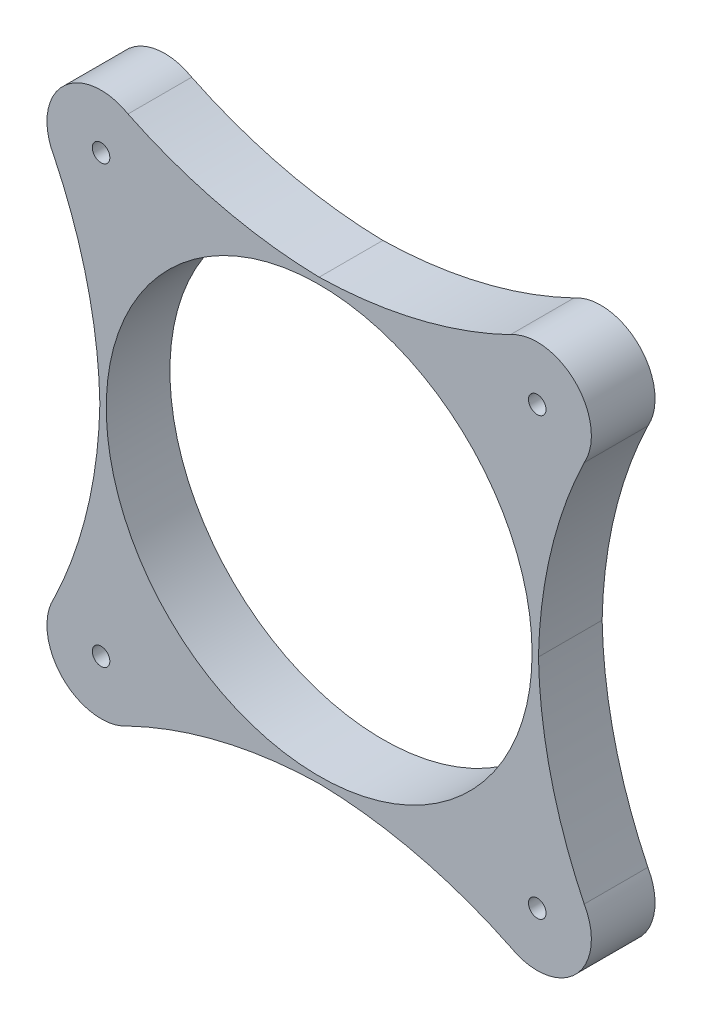
ISO-10303-21;
HEADER;
FILE_DESCRIPTION(('STEP AP214'),'2;1');
FILE_NAME('part.step','',(''),(''),'','','');
FILE_SCHEMA(('AUTOMOTIVE_DESIGN { 1 0 10303 214 1 1 1 1 }'));
ENDSEC;
DATA;
#1=APPLICATION_CONTEXT('core data for automotive mechanical design processes');
#2=APPLICATION_PROTOCOL_DEFINITION('international standard','automotive_design',2000,#1);
#3=PRODUCT_CONTEXT('',#1,'mechanical');
#4=PRODUCT('Part','Part','',(#3));
#5=PRODUCT_RELATED_PRODUCT_CATEGORY('part','',(#4));
#6=PRODUCT_DEFINITION_FORMATION('','',#4);
#7=PRODUCT_DEFINITION_CONTEXT('part definition',#1,'design');
#8=PRODUCT_DEFINITION('design','',#6,#7);
#9=PRODUCT_DEFINITION_SHAPE('','',#8);
#10=(LENGTH_UNIT() NAMED_UNIT(*) SI_UNIT(.MILLI.,.METRE.));
#11=(NAMED_UNIT(*) PLANE_ANGLE_UNIT() SI_UNIT($,.RADIAN.));
#12=(NAMED_UNIT(*) SI_UNIT($,.STERADIAN.) SOLID_ANGLE_UNIT());
#13=UNCERTAINTY_MEASURE_WITH_UNIT(LENGTH_MEASURE(1.E-05),#10,'distance_accuracy_value','');
#14=(GEOMETRIC_REPRESENTATION_CONTEXT(3) GLOBAL_UNCERTAINTY_ASSIGNED_CONTEXT((#13)) GLOBAL_UNIT_ASSIGNED_CONTEXT((#10,
#11,#12)) REPRESENTATION_CONTEXT('',''));
#15=CARTESIAN_POINT('',(0.,0.,0.));
#16=DIRECTION('',(0.,0.,1.));
#17=DIRECTION('',(1.,0.,0.));
#18=AXIS2_PLACEMENT_3D('',#15,#16,#17);
#19=CARTESIAN_POINT('',(-179.289571714901,41.6193978731311,25.4));
#20=DIRECTION('',(0.,0.,1.));
#21=DIRECTION('',(1.,0.,0.));
#22=AXIS2_PLACEMENT_3D('',#19,#20,#21);
#23=PLANE('',#22);
#24=CARTESIAN_POINT('',(86.9962311728574,86.9962311728574,25.4));
#25=DIRECTION('',(0.,0.,-1.));
#26=DIRECTION('',(-1.,0.,0.));
#27=AXIS2_PLACEMENT_3D('',#24,#25,#26);
#28=CIRCLE('',#27,3.50000000000004);
#29=CARTESIAN_POINT('',(83.4962311728574,86.9962311728574,25.4));
#30=VERTEX_POINT('',#29);
#31=EDGE_CURVE('E333',#30,#30,#28,.T.);
#32=ORIENTED_EDGE('',*,*,#31,.T.);
#33=EDGE_LOOP('',(#32));
#34=FACE_BOUND('',#33,.T.);
#35=CARTESIAN_POINT('',(-86.9962311728574,86.9962311728574,25.4));
#36=DIRECTION('',(0.,0.,-1.));
#37=DIRECTION('',(-1.,0.,0.));
#38=AXIS2_PLACEMENT_3D('',#35,#36,#37);
#39=CIRCLE('',#38,3.50000000000004);
#40=CARTESIAN_POINT('',(-90.4962311728575,86.9962311728574,25.4));
#41=VERTEX_POINT('',#40);
#42=EDGE_CURVE('E344',#41,#41,#39,.T.);
#43=ORIENTED_EDGE('',*,*,#42,.T.);
#44=EDGE_LOOP('',(#43));
#45=FACE_BOUND('',#44,.T.);
#46=CARTESIAN_POINT('',(-86.9962311728574,-86.9962311728574,25.4));
#47=DIRECTION('',(0.,0.,-1.));
#48=DIRECTION('',(-1.,0.,0.));
#49=AXIS2_PLACEMENT_3D('',#46,#47,#48);
#50=CIRCLE('',#49,3.50000000000004);
#51=CARTESIAN_POINT('',(-90.4962311728575,-86.9962311728574,25.4));
#52=VERTEX_POINT('',#51);
#53=EDGE_CURVE('E356',#52,#52,#50,.T.);
#54=ORIENTED_EDGE('',*,*,#53,.T.);
#55=EDGE_LOOP('',(#54));
#56=FACE_BOUND('',#55,.T.);
#57=CARTESIAN_POINT('',(86.9962311728574,-86.9962311728574,25.4));
#58=DIRECTION('',(0.,0.,-1.));
#59=DIRECTION('',(-1.,0.,0.));
#60=AXIS2_PLACEMENT_3D('',#57,#58,#59);
#61=CIRCLE('',#60,3.50000000000004);
#62=CARTESIAN_POINT('',(83.4962311728574,-86.9962311728574,25.4));
#63=VERTEX_POINT('',#62);
#64=EDGE_CURVE('E368',#63,#63,#61,.T.);
#65=ORIENTED_EDGE('',*,*,#64,.T.);
#66=EDGE_LOOP('',(#65));
#67=FACE_BOUND('',#66,.T.);
#68=CARTESIAN_POINT('',(-86.9962311728574,86.9962311728574,25.4));
#69=DIRECTION('',(0.,0.,1.));
#70=DIRECTION('',(1.,0.,0.));
#71=AXIS2_PLACEMENT_3D('',#68,#69,#70);
#72=CIRCLE('',#71,21.5899999999997);
#73=CARTESIAN_POINT('',(-76.2460057365222,105.719498864903,25.4));
#74=VERTEX_POINT('',#73);
#75=CARTESIAN_POINT('',(-105.719498864904,76.2460057365258,25.4));
#76=VERTEX_POINT('',#75);
#77=EDGE_CURVE('E181',#74,#76,#72,.T.);
#78=ORIENTED_EDGE('',*,*,#77,.T.);
#79=CARTESIAN_POINT('',(-271.582912256946,-3.75743542659512,25.4));
#80=DIRECTION('',(0.,0.,-1.));
#81=DIRECTION('',(1.,0.,0.));
#82=AXIS2_PLACEMENT_3D('',#79,#80,#81);
#83=CIRCLE('',#82,184.15);
#84=CARTESIAN_POINT('',(-87.4712500000017,-3.55509892357997E-11,25.4));
#85=VERTEX_POINT('',#84);
#86=EDGE_CURVE('E109',#76,#85,#83,.T.);
#87=ORIENTED_EDGE('',*,*,#86,.T.);
#88=CARTESIAN_POINT('',(-271.582912256946,3.75743542659512,25.4));
#89=DIRECTION('',(0.,0.,-1.));
#90=DIRECTION('',(1.,0.,0.));
#91=AXIS2_PLACEMENT_3D('',#88,#89,#90);
#92=CIRCLE('',#91,184.150000000001);
#93=CARTESIAN_POINT('',(-105.719498864905,-76.2460057365257,25.4));
#94=VERTEX_POINT('',#93);
#95=EDGE_CURVE('E208',#85,#94,#92,.T.);
#96=ORIENTED_EDGE('',*,*,#95,.T.);
#97=CARTESIAN_POINT('',(-86.9962311728574,-86.9962311728574,25.4));
#98=DIRECTION('',(0.,0.,1.));
#99=DIRECTION('',(1.,0.,0.));
#100=AXIS2_PLACEMENT_3D('',#97,#98,#99);
#101=CIRCLE('',#100,21.5900000000002);
#102=CARTESIAN_POINT('',(-76.2460057365222,-105.719498864903,25.4));
#103=VERTEX_POINT('',#102);
#104=EDGE_CURVE('E227',#94,#103,#101,.T.);
#105=ORIENTED_EDGE('',*,*,#104,.T.);
#106=CARTESIAN_POINT('',(3.75743542659805,-271.582912256944,25.4));
#107=DIRECTION('',(0.,0.,-1.));
#108=DIRECTION('',(1.,0.,0.));
#109=AXIS2_PLACEMENT_3D('',#106,#107,#108);
#110=CIRCLE('',#109,184.15);
#111=CARTESIAN_POINT('',(-1.31318567131444E-12,-87.4712499999997,25.4));
#112=VERTEX_POINT('',#111);
#113=EDGE_CURVE('E224',#103,#112,#110,.T.);
#114=ORIENTED_EDGE('',*,*,#113,.T.);
#115=CARTESIAN_POINT('',(-3.75743542659805,-271.582912256944,25.4));
#116=DIRECTION('',(0.,0.,-1.));
#117=DIRECTION('',(1.,0.,0.));
#118=AXIS2_PLACEMENT_3D('',#115,#116,#117);
#119=CIRCLE('',#118,184.15);
#120=CARTESIAN_POINT('',(76.2460057365225,-105.719498864902,25.4));
#121=VERTEX_POINT('',#120);
#122=EDGE_CURVE('E226',#112,#121,#119,.T.);
#123=ORIENTED_EDGE('',*,*,#122,.T.);
#124=CARTESIAN_POINT('',(86.9962311728574,-86.9962311728574,25.4));
#125=DIRECTION('',(0.,0.,1.));
#126=DIRECTION('',(1.,0.,0.));
#127=AXIS2_PLACEMENT_3D('',#124,#125,#126);
#128=CIRCLE('',#127,21.5899999999995);
#129=CARTESIAN_POINT('',(105.719498864904,-76.246005736526,25.4));
#130=VERTEX_POINT('',#129);
#131=EDGE_CURVE('E229',#121,#130,#128,.T.);
#132=ORIENTED_EDGE('',*,*,#131,.T.);
#133=CARTESIAN_POINT('',(271.582912256946,3.75743542659512,25.4));
#134=DIRECTION('',(0.,0.,-1.));
#135=DIRECTION('',(1.,0.,0.));
#136=AXIS2_PLACEMENT_3D('',#133,#134,#135);
#137=CIRCLE('',#136,184.150000000001);
#138=CARTESIAN_POINT('',(87.4712500000013,0.,25.4));
#139=VERTEX_POINT('',#138);
#140=EDGE_CURVE('E235',#130,#139,#137,.T.);
#141=ORIENTED_EDGE('',*,*,#140,.T.);
#142=CARTESIAN_POINT('',(271.582912256946,-3.75743542659512,25.4));
#143=DIRECTION('',(0.,0.,-1.));
#144=DIRECTION('',(1.,0.,0.));
#145=AXIS2_PLACEMENT_3D('',#142,#143,#144);
#146=CIRCLE('',#145,184.15);
#147=CARTESIAN_POINT('',(105.719498864905,76.2460057365256,25.4));
#148=VERTEX_POINT('',#147);
#149=EDGE_CURVE('E140',#139,#148,#146,.T.);
#150=ORIENTED_EDGE('',*,*,#149,.T.);
#151=CARTESIAN_POINT('',(86.9962311728574,86.9962311728574,25.4));
#152=DIRECTION('',(0.,0.,1.));
#153=DIRECTION('',(1.,0.,0.));
#154=AXIS2_PLACEMENT_3D('',#151,#152,#153);
#155=CIRCLE('',#154,21.5900000000002);
#156=CARTESIAN_POINT('',(76.2460057365222,105.719498864903,25.4));
#157=VERTEX_POINT('',#156);
#158=EDGE_CURVE('E134',#148,#157,#155,.T.);
#159=ORIENTED_EDGE('',*,*,#158,.T.);
#160=CARTESIAN_POINT('',(-3.75743542659805,271.582912256944,25.4));
#161=DIRECTION('',(0.,0.,-1.));
#162=DIRECTION('',(1.,0.,0.));
#163=AXIS2_PLACEMENT_3D('',#160,#161,#162);
#164=CIRCLE('',#163,184.15);
#165=CARTESIAN_POINT('',(1.25420507313123E-12,87.4712499999999,25.4));
#166=VERTEX_POINT('',#165);
#167=EDGE_CURVE('E138',#157,#166,#164,.T.);
#168=ORIENTED_EDGE('',*,*,#167,.T.);
#169=CARTESIAN_POINT('',(3.75743542659805,271.582912256944,25.4));
#170=DIRECTION('',(0.,0.,-1.));
#171=DIRECTION('',(1.,0.,0.));
#172=AXIS2_PLACEMENT_3D('',#169,#170,#171);
#173=CIRCLE('',#172,184.15);
#174=EDGE_CURVE('E54',#166,#74,#173,.T.);
#175=ORIENTED_EDGE('',*,*,#174,.T.);
#176=EDGE_LOOP('',(#78,#87,#96,#105,#114,#123,#132,#141,#150,#159,#168,#175));
#177=FACE_BOUND('',#176,.T.);
#178=CARTESIAN_POINT('',(0.,0.,25.4));
#179=DIRECTION('',(0.,0.,1.));
#180=DIRECTION('',(1.,0.,0.));
#181=AXIS2_PLACEMENT_3D('',#178,#179,#180);
#182=CIRCLE('',#181,84.93125);
#183=CARTESIAN_POINT('',(84.93125,0.,25.4));
#184=VERTEX_POINT('',#183);
#185=EDGE_CURVE('E162',#184,#184,#182,.T.);
#186=ORIENTED_EDGE('',*,*,#185,.F.);
#187=EDGE_LOOP('',(#186));
#188=FACE_BOUND('',#187,.T.);
#189=ADVANCED_FACE('F37',(#34,#45,#56,#67,#177,#188),#23,.T.);
#190=CARTESIAN_POINT('',(-179.289571714901,41.6193978731311,0.));
#191=DIRECTION('',(0.,0.,1.));
#192=DIRECTION('',(1.,0.,0.));
#193=AXIS2_PLACEMENT_3D('',#190,#191,#192);
#194=PLANE('',#193);
#195=CARTESIAN_POINT('',(86.9962311728574,86.9962311728574,0.));
#196=DIRECTION('',(0.,0.,-1.));
#197=DIRECTION('',(-1.,0.,0.));
#198=AXIS2_PLACEMENT_3D('',#195,#196,#197);
#199=CIRCLE('',#198,7.2735);
#200=CARTESIAN_POINT('',(79.7227311728574,86.9962311728574,0.));
#201=VERTEX_POINT('',#200);
#202=EDGE_CURVE('E326',#201,#201,#199,.T.);
#203=ORIENTED_EDGE('',*,*,#202,.F.);
#204=EDGE_LOOP('',(#203));
#205=FACE_BOUND('',#204,.T.);
#206=CARTESIAN_POINT('',(-86.9962311728574,86.9962311728574,0.));
#207=DIRECTION('',(0.,0.,-1.));
#208=DIRECTION('',(-1.,0.,0.));
#209=AXIS2_PLACEMENT_3D('',#206,#207,#208);
#210=CIRCLE('',#209,7.2735);
#211=CARTESIAN_POINT('',(-94.2697311728574,86.9962311728574,0.));
#212=VERTEX_POINT('',#211);
#213=EDGE_CURVE('E335',#212,#212,#210,.T.);
#214=ORIENTED_EDGE('',*,*,#213,.F.);
#215=EDGE_LOOP('',(#214));
#216=FACE_BOUND('',#215,.T.);
#217=CARTESIAN_POINT('',(-86.9962311728574,-86.9962311728574,0.));
#218=DIRECTION('',(0.,0.,-1.));
#219=DIRECTION('',(-1.,0.,0.));
#220=AXIS2_PLACEMENT_3D('',#217,#218,#219);
#221=CIRCLE('',#220,7.2735);
#222=CARTESIAN_POINT('',(-94.2697311728574,-86.9962311728574,0.));
#223=VERTEX_POINT('',#222);
#224=EDGE_CURVE('E347',#223,#223,#221,.T.);
#225=ORIENTED_EDGE('',*,*,#224,.F.);
#226=EDGE_LOOP('',(#225));
#227=FACE_BOUND('',#226,.T.);
#228=CARTESIAN_POINT('',(86.9962311728574,-86.9962311728574,0.));
#229=DIRECTION('',(0.,0.,-1.));
#230=DIRECTION('',(-1.,0.,0.));
#231=AXIS2_PLACEMENT_3D('',#228,#229,#230);
#232=CIRCLE('',#231,7.2735);
#233=CARTESIAN_POINT('',(79.7227311728574,-86.9962311728574,0.));
#234=VERTEX_POINT('',#233);
#235=EDGE_CURVE('E359',#234,#234,#232,.T.);
#236=ORIENTED_EDGE('',*,*,#235,.F.);
#237=EDGE_LOOP('',(#236));
#238=FACE_BOUND('',#237,.T.);
#239=CARTESIAN_POINT('',(-86.9962311728574,86.9962311728574,0.));
#240=DIRECTION('',(0.,0.,1.));
#241=DIRECTION('',(1.,0.,0.));
#242=AXIS2_PLACEMENT_3D('',#239,#240,#241);
#243=CIRCLE('',#242,21.5899999999997);
#244=CARTESIAN_POINT('',(-76.2460057365222,105.719498864903,0.));
#245=VERTEX_POINT('',#244);
#246=CARTESIAN_POINT('',(-105.719498864904,76.2460057365258,0.));
#247=VERTEX_POINT('',#246);
#248=EDGE_CURVE('E158',#245,#247,#243,.T.);
#249=ORIENTED_EDGE('',*,*,#248,.F.);
#250=CARTESIAN_POINT('',(3.75743542659805,271.582912256944,0.));
#251=DIRECTION('',(0.,0.,-1.));
#252=DIRECTION('',(1.,0.,0.));
#253=AXIS2_PLACEMENT_3D('',#250,#251,#252);
#254=CIRCLE('',#253,184.15);
#255=CARTESIAN_POINT('',(1.25420507313123E-12,87.4712499999999,0.));
#256=VERTEX_POINT('',#255);
#257=EDGE_CURVE('E101',#256,#245,#254,.T.);
#258=ORIENTED_EDGE('',*,*,#257,.F.);
#259=CARTESIAN_POINT('',(-3.75743542659805,271.582912256944,0.));
#260=DIRECTION('',(0.,0.,-1.));
#261=DIRECTION('',(1.,0.,0.));
#262=AXIS2_PLACEMENT_3D('',#259,#260,#261);
#263=CIRCLE('',#262,184.15);
#264=CARTESIAN_POINT('',(76.2460057365222,105.719498864903,0.));
#265=VERTEX_POINT('',#264);
#266=EDGE_CURVE('E95',#265,#256,#263,.T.);
#267=ORIENTED_EDGE('',*,*,#266,.F.);
#268=CARTESIAN_POINT('',(86.9962311728574,86.9962311728574,0.));
#269=DIRECTION('',(0.,0.,1.));
#270=DIRECTION('',(1.,0.,0.));
#271=AXIS2_PLACEMENT_3D('',#268,#269,#270);
#272=CIRCLE('',#271,21.5900000000002);
#273=CARTESIAN_POINT('',(105.719498864905,76.2460057365256,0.));
#274=VERTEX_POINT('',#273);
#275=EDGE_CURVE('E148',#274,#265,#272,.T.);
#276=ORIENTED_EDGE('',*,*,#275,.F.);
#277=CARTESIAN_POINT('',(271.582912256946,-3.75743542659512,0.));
#278=DIRECTION('',(0.,0.,-1.));
#279=DIRECTION('',(1.,0.,0.));
#280=AXIS2_PLACEMENT_3D('',#277,#278,#279);
#281=CIRCLE('',#280,184.15);
#282=CARTESIAN_POINT('',(87.4712500000013,0.,0.));
#283=VERTEX_POINT('',#282);
#284=EDGE_CURVE('E176',#283,#274,#281,.T.);
#285=ORIENTED_EDGE('',*,*,#284,.F.);
#286=CARTESIAN_POINT('',(271.582912256946,3.75743542659512,0.));
#287=DIRECTION('',(0.,0.,-1.));
#288=DIRECTION('',(1.,0.,0.));
#289=AXIS2_PLACEMENT_3D('',#286,#287,#288);
#290=CIRCLE('',#289,184.150000000001);
#291=CARTESIAN_POINT('',(105.719498864904,-76.246005736526,0.));
#292=VERTEX_POINT('',#291);
#293=EDGE_CURVE('E174',#292,#283,#290,.T.);
#294=ORIENTED_EDGE('',*,*,#293,.F.);
#295=CARTESIAN_POINT('',(86.9962311728574,-86.9962311728574,0.));
#296=DIRECTION('',(0.,0.,1.));
#297=DIRECTION('',(1.,0.,0.));
#298=AXIS2_PLACEMENT_3D('',#295,#296,#297);
#299=CIRCLE('',#298,21.5899999999995);
#300=CARTESIAN_POINT('',(76.2460057365225,-105.719498864902,0.));
#301=VERTEX_POINT('',#300);
#302=EDGE_CURVE('E172',#301,#292,#299,.T.);
#303=ORIENTED_EDGE('',*,*,#302,.F.);
#304=CARTESIAN_POINT('',(-3.75743542659805,-271.582912256944,0.));
#305=DIRECTION('',(0.,0.,-1.));
#306=DIRECTION('',(1.,0.,0.));
#307=AXIS2_PLACEMENT_3D('',#304,#305,#306);
#308=CIRCLE('',#307,184.15);
#309=CARTESIAN_POINT('',(-1.31318567131444E-12,-87.4712499999997,0.));
#310=VERTEX_POINT('',#309);
#311=EDGE_CURVE('E170',#310,#301,#308,.T.);
#312=ORIENTED_EDGE('',*,*,#311,.F.);
#313=CARTESIAN_POINT('',(3.75743542659805,-271.582912256944,0.));
#314=DIRECTION('',(0.,0.,-1.));
#315=DIRECTION('',(1.,0.,0.));
#316=AXIS2_PLACEMENT_3D('',#313,#314,#315);
#317=CIRCLE('',#316,184.15);
#318=CARTESIAN_POINT('',(-76.2460057365222,-105.719498864903,0.));
#319=VERTEX_POINT('',#318);
#320=EDGE_CURVE('E168',#319,#310,#317,.T.);
#321=ORIENTED_EDGE('',*,*,#320,.F.);
#322=CARTESIAN_POINT('',(-86.9962311728574,-86.9962311728574,0.));
#323=DIRECTION('',(0.,0.,1.));
#324=DIRECTION('',(1.,0.,0.));
#325=AXIS2_PLACEMENT_3D('',#322,#323,#324);
#326=CIRCLE('',#325,21.5900000000002);
#327=CARTESIAN_POINT('',(-105.719498864905,-76.2460057365257,0.));
#328=VERTEX_POINT('',#327);
#329=EDGE_CURVE('E166',#328,#319,#326,.T.);
#330=ORIENTED_EDGE('',*,*,#329,.F.);
#331=CARTESIAN_POINT('',(-271.582912256946,3.75743542659512,0.));
#332=DIRECTION('',(0.,0.,-1.));
#333=DIRECTION('',(1.,0.,0.));
#334=AXIS2_PLACEMENT_3D('',#331,#332,#333);
#335=CIRCLE('',#334,184.150000000001);
#336=CARTESIAN_POINT('',(-87.4712500000017,-3.55509892357997E-11,0.));
#337=VERTEX_POINT('',#336);
#338=EDGE_CURVE('E164',#337,#328,#335,.T.);
#339=ORIENTED_EDGE('',*,*,#338,.F.);
#340=CARTESIAN_POINT('',(-271.582912256946,-3.75743542659512,0.));
#341=DIRECTION('',(0.,0.,-1.));
#342=DIRECTION('',(1.,0.,0.));
#343=AXIS2_PLACEMENT_3D('',#340,#341,#342);
#344=CIRCLE('',#343,184.15);
#345=EDGE_CURVE('E161',#247,#337,#344,.T.);
#346=ORIENTED_EDGE('',*,*,#345,.F.);
#347=EDGE_LOOP('',(#249,#258,#267,#276,#285,#294,#303,#312,#321,#330,#339,#346));
#348=FACE_BOUND('',#347,.T.);
#349=CARTESIAN_POINT('',(0.,0.,0.));
#350=DIRECTION('',(0.,0.,1.));
#351=DIRECTION('',(1.,0.,0.));
#352=AXIS2_PLACEMENT_3D('',#349,#350,#351);
#353=CIRCLE('',#352,84.93125);
#354=CARTESIAN_POINT('',(84.93125,0.,0.));
#355=VERTEX_POINT('',#354);
#356=EDGE_CURVE('E371',#355,#355,#353,.T.);
#357=ORIENTED_EDGE('',*,*,#356,.T.);
#358=EDGE_LOOP('',(#357));
#359=FACE_BOUND('',#358,.T.);
#360=ADVANCED_FACE('F212',(#205,#216,#227,#238,#348,#359),#194,.F.);
#361=CARTESIAN_POINT('',(-86.9962311728574,86.9962311728574,25.4));
#362=DIRECTION('',(0.,0.,-1.));
#363=DIRECTION('',(-1.,0.,0.));
#364=AXIS2_PLACEMENT_3D('',#361,#362,#363);
#365=CYLINDRICAL_SURFACE('',#364,21.5899999999997);
#366=ORIENTED_EDGE('',*,*,#248,.T.);
#367=DIRECTION('',(0.,0.,-1.));
#368=VECTOR('',#367,1.);
#369=CARTESIAN_POINT('',(-105.719498864904,76.2460057365258,25.4));
#370=LINE('',#369,#368);
#371=EDGE_CURVE('E11',#76,#247,#370,.T.);
#372=ORIENTED_EDGE('',*,*,#371,.F.);
#373=ORIENTED_EDGE('',*,*,#77,.F.);
#374=DIRECTION('',(0.,0.,-1.));
#375=VECTOR('',#374,1.);
#376=CARTESIAN_POINT('',(-76.2460057365222,105.719498864903,25.4));
#377=LINE('',#376,#375);
#378=EDGE_CURVE('E154',#74,#245,#377,.T.);
#379=ORIENTED_EDGE('',*,*,#378,.T.);
#380=EDGE_LOOP('',(#366,#372,#373,#379));
#381=FACE_BOUND('',#380,.T.);
#382=ADVANCED_FACE('F39',(#381),#365,.T.);
#383=CARTESIAN_POINT('',(-271.582912256946,-3.75743542659512,25.4));
#384=DIRECTION('',(0.,0.,-1.));
#385=DIRECTION('',(-1.,0.,0.));
#386=AXIS2_PLACEMENT_3D('',#383,#384,#385);
#387=CYLINDRICAL_SURFACE('',#386,184.15);
#388=ORIENTED_EDGE('',*,*,#345,.T.);
#389=DIRECTION('',(0.,0.,-1.));
#390=VECTOR('',#389,1.);
#391=CARTESIAN_POINT('',(-87.4712500000017,-3.55509892357997E-11,25.4));
#392=LINE('',#391,#390);
#393=EDGE_CURVE('E46',#85,#337,#392,.T.);
#394=ORIENTED_EDGE('',*,*,#393,.F.);
#395=ORIENTED_EDGE('',*,*,#86,.F.);
#396=ORIENTED_EDGE('',*,*,#371,.T.);
#397=EDGE_LOOP('',(#388,#394,#395,#396));
#398=FACE_BOUND('',#397,.T.);
#399=ADVANCED_FACE('F480',(#398),#387,.F.);
#400=CARTESIAN_POINT('',(-271.582912256946,3.75743542659512,25.4));
#401=DIRECTION('',(0.,0.,-1.));
#402=DIRECTION('',(-1.,0.,0.));
#403=AXIS2_PLACEMENT_3D('',#400,#401,#402);
#404=CYLINDRICAL_SURFACE('',#403,184.150000000001);
#405=ORIENTED_EDGE('',*,*,#338,.T.);
#406=DIRECTION('',(0.,0.,-1.));
#407=VECTOR('',#406,1.);
#408=CARTESIAN_POINT('',(-105.719498864905,-76.2460057365257,25.4));
#409=LINE('',#408,#407);
#410=EDGE_CURVE('E200',#94,#328,#409,.T.);
#411=ORIENTED_EDGE('',*,*,#410,.F.);
#412=ORIENTED_EDGE('',*,*,#95,.F.);
#413=ORIENTED_EDGE('',*,*,#393,.T.);
#414=EDGE_LOOP('',(#405,#411,#412,#413));
#415=FACE_BOUND('',#414,.T.);
#416=ADVANCED_FACE('F206',(#415),#404,.F.);
#417=CARTESIAN_POINT('',(-86.9962311728574,-86.9962311728574,25.4));
#418=DIRECTION('',(0.,0.,-1.));
#419=DIRECTION('',(-1.,0.,0.));
#420=AXIS2_PLACEMENT_3D('',#417,#418,#419);
#421=CYLINDRICAL_SURFACE('',#420,21.5900000000002);
#422=ORIENTED_EDGE('',*,*,#329,.T.);
#423=DIRECTION('',(0.,0.,-1.));
#424=VECTOR('',#423,1.);
#425=CARTESIAN_POINT('',(-76.2460057365222,-105.719498864903,25.4));
#426=LINE('',#425,#424);
#427=EDGE_CURVE('E197',#103,#319,#426,.T.);
#428=ORIENTED_EDGE('',*,*,#427,.F.);
#429=ORIENTED_EDGE('',*,*,#104,.F.);
#430=ORIENTED_EDGE('',*,*,#410,.T.);
#431=EDGE_LOOP('',(#422,#428,#429,#430));
#432=FACE_BOUND('',#431,.T.);
#433=ADVANCED_FACE('F218',(#432),#421,.T.);
#434=CARTESIAN_POINT('',(3.75743542659805,-271.582912256944,25.4));
#435=DIRECTION('',(0.,0.,-1.));
#436=DIRECTION('',(-1.,0.,0.));
#437=AXIS2_PLACEMENT_3D('',#434,#435,#436);
#438=CYLINDRICAL_SURFACE('',#437,184.15);
#439=ORIENTED_EDGE('',*,*,#320,.T.);
#440=DIRECTION('',(0.,0.,-1.));
#441=VECTOR('',#440,1.);
#442=CARTESIAN_POINT('',(-1.31318567131444E-12,-87.4712499999997,25.4));
#443=LINE('',#442,#441);
#444=EDGE_CURVE('E194',#112,#310,#443,.T.);
#445=ORIENTED_EDGE('',*,*,#444,.F.);
#446=ORIENTED_EDGE('',*,*,#113,.F.);
#447=ORIENTED_EDGE('',*,*,#427,.T.);
#448=EDGE_LOOP('',(#439,#445,#446,#447));
#449=FACE_BOUND('',#448,.T.);
#450=ADVANCED_FACE('F222',(#449),#438,.F.);
#451=CARTESIAN_POINT('',(-3.75743542659805,-271.582912256944,25.4));
#452=DIRECTION('',(0.,0.,-1.));
#453=DIRECTION('',(-1.,0.,0.));
#454=AXIS2_PLACEMENT_3D('',#451,#452,#453);
#455=CYLINDRICAL_SURFACE('',#454,184.15);
#456=ORIENTED_EDGE('',*,*,#311,.T.);
#457=DIRECTION('',(0.,0.,-1.));
#458=VECTOR('',#457,1.);
#459=CARTESIAN_POINT('',(76.2460057365225,-105.719498864902,25.4));
#460=LINE('',#459,#458);
#461=EDGE_CURVE('E191',#121,#301,#460,.T.);
#462=ORIENTED_EDGE('',*,*,#461,.F.);
#463=ORIENTED_EDGE('',*,*,#122,.F.);
#464=ORIENTED_EDGE('',*,*,#444,.T.);
#465=EDGE_LOOP('',(#456,#462,#463,#464));
#466=FACE_BOUND('',#465,.T.);
#467=ADVANCED_FACE('F502',(#466),#455,.F.);
#468=CARTESIAN_POINT('',(86.9962311728574,-86.9962311728574,25.4));
#469=DIRECTION('',(0.,0.,-1.));
#470=DIRECTION('',(-1.,0.,0.));
#471=AXIS2_PLACEMENT_3D('',#468,#469,#470);
#472=CYLINDRICAL_SURFACE('',#471,21.5899999999995);
#473=ORIENTED_EDGE('',*,*,#302,.T.);
#474=DIRECTION('',(0.,0.,-1.));
#475=VECTOR('',#474,1.);
#476=CARTESIAN_POINT('',(105.719498864904,-76.246005736526,25.4));
#477=LINE('',#476,#475);
#478=EDGE_CURVE('E188',#130,#292,#477,.T.);
#479=ORIENTED_EDGE('',*,*,#478,.F.);
#480=ORIENTED_EDGE('',*,*,#131,.F.);
#481=ORIENTED_EDGE('',*,*,#461,.T.);
#482=EDGE_LOOP('',(#473,#479,#480,#481));
#483=FACE_BOUND('',#482,.T.);
#484=ADVANCED_FACE('F509',(#483),#472,.T.);
#485=CARTESIAN_POINT('',(271.582912256946,3.75743542659512,25.4));
#486=DIRECTION('',(0.,0.,-1.));
#487=DIRECTION('',(-1.,0.,0.));
#488=AXIS2_PLACEMENT_3D('',#485,#486,#487);
#489=CYLINDRICAL_SURFACE('',#488,184.150000000001);
#490=ORIENTED_EDGE('',*,*,#293,.T.);
#491=DIRECTION('',(0.,0.,-1.));
#492=VECTOR('',#491,1.);
#493=CARTESIAN_POINT('',(87.4712500000013,0.,25.4));
#494=LINE('',#493,#492);
#495=EDGE_CURVE('E185',#139,#283,#494,.T.);
#496=ORIENTED_EDGE('',*,*,#495,.F.);
#497=ORIENTED_EDGE('',*,*,#140,.F.);
#498=ORIENTED_EDGE('',*,*,#478,.T.);
#499=EDGE_LOOP('',(#490,#496,#497,#498));
#500=FACE_BOUND('',#499,.T.);
#501=ADVANCED_FACE('F241',(#500),#489,.F.);
#502=CARTESIAN_POINT('',(271.582912256946,-3.75743542659512,25.4));
#503=DIRECTION('',(0.,0.,-1.));
#504=DIRECTION('',(-1.,0.,0.));
#505=AXIS2_PLACEMENT_3D('',#502,#503,#504);
#506=CYLINDRICAL_SURFACE('',#505,184.15);
#507=ORIENTED_EDGE('',*,*,#284,.T.);
#508=DIRECTION('',(0.,0.,-1.));
#509=VECTOR('',#508,1.);
#510=CARTESIAN_POINT('',(105.719498864905,76.2460057365256,25.4));
#511=LINE('',#510,#509);
#512=EDGE_CURVE('E149',#148,#274,#511,.T.);
#513=ORIENTED_EDGE('',*,*,#512,.F.);
#514=ORIENTED_EDGE('',*,*,#149,.F.);
#515=ORIENTED_EDGE('',*,*,#495,.T.);
#516=EDGE_LOOP('',(#507,#513,#514,#515));
#517=FACE_BOUND('',#516,.T.);
#518=ADVANCED_FACE('F245',(#517),#506,.F.);
#519=CARTESIAN_POINT('',(86.9962311728574,86.9962311728574,25.4));
#520=DIRECTION('',(0.,0.,-1.));
#521=DIRECTION('',(-1.,0.,0.));
#522=AXIS2_PLACEMENT_3D('',#519,#520,#521);
#523=CYLINDRICAL_SURFACE('',#522,21.5900000000002);
#524=ORIENTED_EDGE('',*,*,#275,.T.);
#525=DIRECTION('',(0.,0.,-1.));
#526=VECTOR('',#525,1.);
#527=CARTESIAN_POINT('',(76.2460057365222,105.719498864903,25.4));
#528=LINE('',#527,#526);
#529=EDGE_CURVE('E145',#157,#265,#528,.T.);
#530=ORIENTED_EDGE('',*,*,#529,.F.);
#531=ORIENTED_EDGE('',*,*,#158,.F.);
#532=ORIENTED_EDGE('',*,*,#512,.T.);
#533=EDGE_LOOP('',(#524,#530,#531,#532));
#534=FACE_BOUND('',#533,.T.);
#535=ADVANCED_FACE('F146',(#534),#523,.T.);
#536=CARTESIAN_POINT('',(-3.75743542659805,271.582912256944,25.4));
#537=DIRECTION('',(0.,0.,-1.));
#538=DIRECTION('',(-1.,0.,0.));
#539=AXIS2_PLACEMENT_3D('',#536,#537,#538);
#540=CYLINDRICAL_SURFACE('',#539,184.15);
#541=ORIENTED_EDGE('',*,*,#266,.T.);
#542=DIRECTION('',(0.,0.,-1.));
#543=VECTOR('',#542,1.);
#544=CARTESIAN_POINT('',(1.25420507313123E-12,87.4712499999999,25.4));
#545=LINE('',#544,#543);
#546=EDGE_CURVE('E150',#166,#256,#545,.T.);
#547=ORIENTED_EDGE('',*,*,#546,.F.);
#548=ORIENTED_EDGE('',*,*,#167,.F.);
#549=ORIENTED_EDGE('',*,*,#529,.T.);
#550=EDGE_LOOP('',(#541,#547,#548,#549));
#551=FACE_BOUND('',#550,.T.);
#552=ADVANCED_FACE('F152',(#551),#540,.F.);
#553=CARTESIAN_POINT('',(3.75743542659805,271.582912256944,25.4));
#554=DIRECTION('',(0.,0.,-1.));
#555=DIRECTION('',(-1.,0.,0.));
#556=AXIS2_PLACEMENT_3D('',#553,#554,#555);
#557=CYLINDRICAL_SURFACE('',#556,184.15);
#558=ORIENTED_EDGE('',*,*,#257,.T.);
#559=ORIENTED_EDGE('',*,*,#378,.F.);
#560=ORIENTED_EDGE('',*,*,#174,.F.);
#561=ORIENTED_EDGE('',*,*,#546,.T.);
#562=EDGE_LOOP('',(#558,#559,#560,#561));
#563=FACE_BOUND('',#562,.T.);
#564=ADVANCED_FACE('F249',(#563),#557,.F.);
#565=CARTESIAN_POINT('',(0.,0.,25.4));
#566=DIRECTION('',(0.,0.,-1.));
#567=DIRECTION('',(-1.,0.,0.));
#568=AXIS2_PLACEMENT_3D('',#565,#566,#567);
#569=CYLINDRICAL_SURFACE('',#568,84.93125);
#570=ORIENTED_EDGE('',*,*,#185,.T.);
#571=EDGE_LOOP('',(#570));
#572=FACE_BOUND('',#571,.T.);
#573=ORIENTED_EDGE('',*,*,#356,.F.);
#574=EDGE_LOOP('',(#573));
#575=FACE_BOUND('',#574,.T.);
#576=ADVANCED_FACE('F251',(#572,#575),#569,.F.);
#577=CARTESIAN_POINT('',(86.9962311728574,-86.9962311728574,0.));
#578=DIRECTION('',(0.,0.,-1.));
#579=DIRECTION('',(-1.,0.,0.));
#580=AXIS2_PLACEMENT_3D('',#577,#578,#579);
#581=CYLINDRICAL_SURFACE('',#580,3.50000000000003);
#582=ORIENTED_EDGE('',*,*,#64,.F.);
#583=EDGE_LOOP('',(#582));
#584=FACE_BOUND('',#583,.T.);
#585=CARTESIAN_POINT('',(86.9962311728574,-86.9962311728574,4.));
#586=DIRECTION('',(0.,0.,-1.));
#587=DIRECTION('',(-1.,0.,0.));
#588=AXIS2_PLACEMENT_3D('',#585,#586,#587);
#589=CIRCLE('',#588,3.50000000000002);
#590=CARTESIAN_POINT('',(83.4962311728574,-86.9962311728574,4.));
#591=VERTEX_POINT('',#590);
#592=EDGE_CURVE('E365',#591,#591,#589,.T.);
#593=ORIENTED_EDGE('',*,*,#592,.T.);
#594=EDGE_LOOP('',(#593));
#595=FACE_BOUND('',#594,.T.);
#596=ADVANCED_FACE('F257',(#584,#595),#581,.F.);
#597=CARTESIAN_POINT('',(90.4962311728574,-86.9962311728574,4.));
#598=DIRECTION('',(0.,0.,1.));
#599=DIRECTION('',(1.,0.,0.));
#600=AXIS2_PLACEMENT_3D('',#597,#598,#599);
#601=PLANE('',#600);
#602=ORIENTED_EDGE('',*,*,#592,.F.);
#603=EDGE_LOOP('',(#602));
#604=FACE_BOUND('',#603,.T.);
#605=CARTESIAN_POINT('',(86.9962311728574,-86.9962311728574,4.));
#606=DIRECTION('',(0.,0.,-1.));
#607=DIRECTION('',(-1.,0.,0.));
#608=AXIS2_PLACEMENT_3D('',#605,#606,#607);
#609=CIRCLE('',#608,7.2735);
#610=CARTESIAN_POINT('',(79.7227311728574,-86.9962311728574,4.));
#611=VERTEX_POINT('',#610);
#612=EDGE_CURVE('E362',#611,#611,#609,.T.);
#613=ORIENTED_EDGE('',*,*,#612,.T.);
#614=EDGE_LOOP('',(#613));
#615=FACE_BOUND('',#614,.T.);
#616=ADVANCED_FACE('F274',(#604,#615),#601,.F.);
#617=CARTESIAN_POINT('',(86.9962311728574,-86.9962311728574,0.));
#618=DIRECTION('',(0.,0.,-1.));
#619=DIRECTION('',(-1.,0.,0.));
#620=AXIS2_PLACEMENT_3D('',#617,#618,#619);
#621=CYLINDRICAL_SURFACE('',#620,7.2735);
#622=ORIENTED_EDGE('',*,*,#612,.F.);
#623=EDGE_LOOP('',(#622));
#624=FACE_BOUND('',#623,.T.);
#625=ORIENTED_EDGE('',*,*,#235,.T.);
#626=EDGE_LOOP('',(#625));
#627=FACE_BOUND('',#626,.T.);
#628=ADVANCED_FACE('F278',(#624,#627),#621,.F.);
#629=CARTESIAN_POINT('',(-86.9962311728574,-86.9962311728574,0.));
#630=DIRECTION('',(0.,0.,-1.));
#631=DIRECTION('',(-1.,0.,0.));
#632=AXIS2_PLACEMENT_3D('',#629,#630,#631);
#633=CYLINDRICAL_SURFACE('',#632,3.50000000000003);
#634=ORIENTED_EDGE('',*,*,#53,.F.);
#635=EDGE_LOOP('',(#634));
#636=FACE_BOUND('',#635,.T.);
#637=CARTESIAN_POINT('',(-86.9962311728574,-86.9962311728574,4.));
#638=DIRECTION('',(0.,0.,-1.));
#639=DIRECTION('',(-1.,0.,0.));
#640=AXIS2_PLACEMENT_3D('',#637,#638,#639);
#641=CIRCLE('',#640,3.50000000000002);
#642=CARTESIAN_POINT('',(-90.4962311728574,-86.9962311728574,4.));
#643=VERTEX_POINT('',#642);
#644=EDGE_CURVE('E353',#643,#643,#641,.T.);
#645=ORIENTED_EDGE('',*,*,#644,.T.);
#646=EDGE_LOOP('',(#645));
#647=FACE_BOUND('',#646,.T.);
#648=ADVANCED_FACE('F282',(#636,#647),#633,.F.);
#649=CARTESIAN_POINT('',(-83.4962311728574,-86.9962311728574,4.));
#650=DIRECTION('',(0.,0.,1.));
#651=DIRECTION('',(1.,0.,0.));
#652=AXIS2_PLACEMENT_3D('',#649,#650,#651);
#653=PLANE('',#652);
#654=ORIENTED_EDGE('',*,*,#644,.F.);
#655=EDGE_LOOP('',(#654));
#656=FACE_BOUND('',#655,.T.);
#657=CARTESIAN_POINT('',(-86.9962311728574,-86.9962311728574,4.));
#658=DIRECTION('',(0.,0.,-1.));
#659=DIRECTION('',(-1.,0.,0.));
#660=AXIS2_PLACEMENT_3D('',#657,#658,#659);
#661=CIRCLE('',#660,7.2735);
#662=CARTESIAN_POINT('',(-94.2697311728574,-86.9962311728574,4.));
#663=VERTEX_POINT('',#662);
#664=EDGE_CURVE('E350',#663,#663,#661,.T.);
#665=ORIENTED_EDGE('',*,*,#664,.T.);
#666=EDGE_LOOP('',(#665));
#667=FACE_BOUND('',#666,.T.);
#668=ADVANCED_FACE('F286',(#656,#667),#653,.F.);
#669=CARTESIAN_POINT('',(-86.9962311728574,-86.9962311728574,0.));
#670=DIRECTION('',(0.,0.,-1.));
#671=DIRECTION('',(-1.,0.,0.));
#672=AXIS2_PLACEMENT_3D('',#669,#670,#671);
#673=CYLINDRICAL_SURFACE('',#672,7.2735);
#674=ORIENTED_EDGE('',*,*,#664,.F.);
#675=EDGE_LOOP('',(#674));
#676=FACE_BOUND('',#675,.T.);
#677=ORIENTED_EDGE('',*,*,#224,.T.);
#678=EDGE_LOOP('',(#677));
#679=FACE_BOUND('',#678,.T.);
#680=ADVANCED_FACE('F290',(#676,#679),#673,.F.);
#681=CARTESIAN_POINT('',(-86.9962311728574,86.9962311728574,0.));
#682=DIRECTION('',(0.,0.,-1.));
#683=DIRECTION('',(-1.,0.,0.));
#684=AXIS2_PLACEMENT_3D('',#681,#682,#683);
#685=CYLINDRICAL_SURFACE('',#684,3.50000000000003);
#686=ORIENTED_EDGE('',*,*,#42,.F.);
#687=EDGE_LOOP('',(#686));
#688=FACE_BOUND('',#687,.T.);
#689=CARTESIAN_POINT('',(-86.9962311728574,86.9962311728574,4.));
#690=DIRECTION('',(0.,0.,-1.));
#691=DIRECTION('',(-1.,0.,0.));
#692=AXIS2_PLACEMENT_3D('',#689,#690,#691);
#693=CIRCLE('',#692,3.50000000000002);
#694=CARTESIAN_POINT('',(-90.4962311728574,86.9962311728574,4.));
#695=VERTEX_POINT('',#694);
#696=EDGE_CURVE('E341',#695,#695,#693,.T.);
#697=ORIENTED_EDGE('',*,*,#696,.T.);
#698=EDGE_LOOP('',(#697));
#699=FACE_BOUND('',#698,.T.);
#700=ADVANCED_FACE('F294',(#688,#699),#685,.F.);
#701=CARTESIAN_POINT('',(-83.4962311728574,86.9962311728574,4.));
#702=DIRECTION('',(0.,0.,1.));
#703=DIRECTION('',(1.,0.,0.));
#704=AXIS2_PLACEMENT_3D('',#701,#702,#703);
#705=PLANE('',#704);
#706=ORIENTED_EDGE('',*,*,#696,.F.);
#707=EDGE_LOOP('',(#706));
#708=FACE_BOUND('',#707,.T.);
#709=CARTESIAN_POINT('',(-86.9962311728574,86.9962311728574,4.));
#710=DIRECTION('',(0.,0.,-1.));
#711=DIRECTION('',(-1.,0.,0.));
#712=AXIS2_PLACEMENT_3D('',#709,#710,#711);
#713=CIRCLE('',#712,7.2735);
#714=CARTESIAN_POINT('',(-94.2697311728574,86.9962311728574,4.));
#715=VERTEX_POINT('',#714);
#716=EDGE_CURVE('E338',#715,#715,#713,.T.);
#717=ORIENTED_EDGE('',*,*,#716,.T.);
#718=EDGE_LOOP('',(#717));
#719=FACE_BOUND('',#718,.T.);
#720=ADVANCED_FACE('F298',(#708,#719),#705,.F.);
#721=CARTESIAN_POINT('',(-86.9962311728574,86.9962311728574,0.));
#722=DIRECTION('',(0.,0.,-1.));
#723=DIRECTION('',(-1.,0.,0.));
#724=AXIS2_PLACEMENT_3D('',#721,#722,#723);
#725=CYLINDRICAL_SURFACE('',#724,7.2735);
#726=ORIENTED_EDGE('',*,*,#716,.F.);
#727=EDGE_LOOP('',(#726));
#728=FACE_BOUND('',#727,.T.);
#729=ORIENTED_EDGE('',*,*,#213,.T.);
#730=EDGE_LOOP('',(#729));
#731=FACE_BOUND('',#730,.T.);
#732=ADVANCED_FACE('F302',(#728,#731),#725,.F.);
#733=CARTESIAN_POINT('',(86.9962311728574,86.9962311728574,0.));
#734=DIRECTION('',(0.,0.,-1.));
#735=DIRECTION('',(-1.,0.,0.));
#736=AXIS2_PLACEMENT_3D('',#733,#734,#735);
#737=CYLINDRICAL_SURFACE('',#736,3.50000000000003);
#738=ORIENTED_EDGE('',*,*,#31,.F.);
#739=EDGE_LOOP('',(#738));
#740=FACE_BOUND('',#739,.T.);
#741=CARTESIAN_POINT('',(86.9962311728574,86.9962311728574,4.));
#742=DIRECTION('',(0.,0.,-1.));
#743=DIRECTION('',(-1.,0.,0.));
#744=AXIS2_PLACEMENT_3D('',#741,#742,#743);
#745=CIRCLE('',#744,3.50000000000002);
#746=CARTESIAN_POINT('',(83.4962311728574,86.9962311728574,4.));
#747=VERTEX_POINT('',#746);
#748=EDGE_CURVE('E328',#747,#747,#745,.T.);
#749=ORIENTED_EDGE('',*,*,#748,.T.);
#750=EDGE_LOOP('',(#749));
#751=FACE_BOUND('',#750,.T.);
#752=ADVANCED_FACE('F306',(#740,#751),#737,.F.);
#753=CARTESIAN_POINT('',(90.4962311728574,86.9962311728574,4.));
#754=DIRECTION('',(0.,0.,1.));
#755=DIRECTION('',(1.,0.,0.));
#756=AXIS2_PLACEMENT_3D('',#753,#754,#755);
#757=PLANE('',#756);
#758=ORIENTED_EDGE('',*,*,#748,.F.);
#759=EDGE_LOOP('',(#758));
#760=FACE_BOUND('',#759,.T.);
#761=CARTESIAN_POINT('',(86.9962311728574,86.9962311728574,4.));
#762=DIRECTION('',(0.,0.,-1.));
#763=DIRECTION('',(-1.,0.,0.));
#764=AXIS2_PLACEMENT_3D('',#761,#762,#763);
#765=CIRCLE('',#764,7.2735);
#766=CARTESIAN_POINT('',(79.7227311728574,86.9962311728574,4.));
#767=VERTEX_POINT('',#766);
#768=EDGE_CURVE('E323',#767,#767,#765,.T.);
#769=ORIENTED_EDGE('',*,*,#768,.T.);
#770=EDGE_LOOP('',(#769));
#771=FACE_BOUND('',#770,.T.);
#772=ADVANCED_FACE('F310',(#760,#771),#757,.F.);
#773=CARTESIAN_POINT('',(86.9962311728574,86.9962311728574,0.));
#774=DIRECTION('',(0.,0.,-1.));
#775=DIRECTION('',(-1.,0.,0.));
#776=AXIS2_PLACEMENT_3D('',#773,#774,#775);
#777=CYLINDRICAL_SURFACE('',#776,7.2735);
#778=ORIENTED_EDGE('',*,*,#768,.F.);
#779=EDGE_LOOP('',(#778));
#780=FACE_BOUND('',#779,.T.);
#781=ORIENTED_EDGE('',*,*,#202,.T.);
#782=EDGE_LOOP('',(#781));
#783=FACE_BOUND('',#782,.T.);
#784=ADVANCED_FACE('F314',(#780,#783),#777,.F.);
#785=CLOSED_SHELL('',(#189,#360,#382,#399,#416,#433,#450,#467,#484,#501,#518,#535,#552,#564,
#576,#596,#616,#628,#648,#668,#680,#700,#720,#732,#752,#772,#784));
#786=MANIFOLD_SOLID_BREP('B2',#785);
#787=ADVANCED_BREP_SHAPE_REPRESENTATION('',(#18,#786),#14);
#788=SHAPE_DEFINITION_REPRESENTATION(#9,#787);
ENDSEC;
END-ISO-10303-21;
